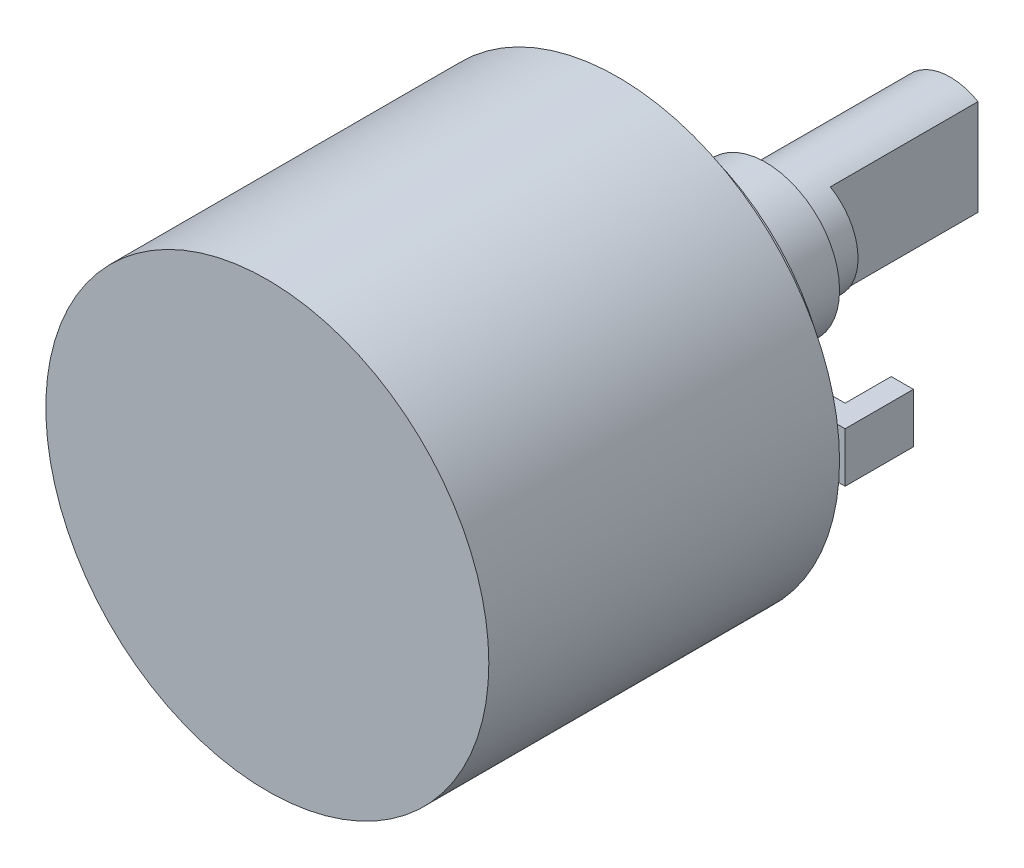
ISO-10303-21;
HEADER;
FILE_DESCRIPTION(('STEP AP214'),'2;1');
FILE_NAME('part.step','',(''),(''),'','','');
FILE_SCHEMA(('AUTOMOTIVE_DESIGN { 1 0 10303 214 1 1 1 1 }'));
ENDSEC;
DATA;
#1=APPLICATION_CONTEXT('core data for automotive mechanical design processes');
#2=APPLICATION_PROTOCOL_DEFINITION('international standard','automotive_design',2000,#1);
#3=PRODUCT_CONTEXT('',#1,'mechanical');
#4=PRODUCT('Part','Part','',(#3));
#5=PRODUCT_RELATED_PRODUCT_CATEGORY('part','',(#4));
#6=PRODUCT_DEFINITION_FORMATION('','',#4);
#7=PRODUCT_DEFINITION_CONTEXT('part definition',#1,'design');
#8=PRODUCT_DEFINITION('design','',#6,#7);
#9=PRODUCT_DEFINITION_SHAPE('','',#8);
#10=(LENGTH_UNIT() NAMED_UNIT(*) SI_UNIT(.MILLI.,.METRE.));
#11=(NAMED_UNIT(*) PLANE_ANGLE_UNIT() SI_UNIT($,.RADIAN.));
#12=(NAMED_UNIT(*) SI_UNIT($,.STERADIAN.) SOLID_ANGLE_UNIT());
#13=UNCERTAINTY_MEASURE_WITH_UNIT(LENGTH_MEASURE(1.E-05),#10,'distance_accuracy_value','');
#14=(GEOMETRIC_REPRESENTATION_CONTEXT(3) GLOBAL_UNCERTAINTY_ASSIGNED_CONTEXT((#13)) GLOBAL_UNIT_ASSIGNED_CONTEXT((#10,
#11,#12)) REPRESENTATION_CONTEXT('',''));
#15=CARTESIAN_POINT('',(0.,0.,0.));
#16=DIRECTION('',(0.,0.,1.));
#17=DIRECTION('',(1.,0.,0.));
#18=AXIS2_PLACEMENT_3D('',#15,#16,#17);
#19=CARTESIAN_POINT('',(0.,10.,0.));
#20=DIRECTION('',(0.,0.,1.));
#21=DIRECTION('',(1.,0.,0.));
#22=AXIS2_PLACEMENT_3D('',#19,#20,#21);
#23=PLANE('',#22);
#24=CARTESIAN_POINT('',(0.,0.,0.));
#25=DIRECTION('',(0.,0.,1.));
#26=DIRECTION('',(1.,0.,0.));
#27=AXIS2_PLACEMENT_3D('',#24,#25,#26);
#28=CIRCLE('',#27,4.);
#29=CARTESIAN_POINT('',(4.,0.,0.));
#30=VERTEX_POINT('',#29);
#31=EDGE_CURVE('E194',#30,#30,#28,.T.);
#32=ORIENTED_EDGE('',*,*,#31,.T.);
#33=EDGE_LOOP('',(#32));
#34=FACE_BOUND('',#33,.T.);
#35=DIRECTION('',(0.,1.,0.));
#36=VECTOR('',#35,1.);
#37=CARTESIAN_POINT('',(10.8,1.35,0.));
#38=LINE('',#37,#36);
#39=CARTESIAN_POINT('',(10.8,-1.35,0.));
#40=VERTEX_POINT('',#39);
#41=CARTESIAN_POINT('',(10.8,1.35,0.));
#42=VERTEX_POINT('',#41);
#43=EDGE_CURVE('E126',#40,#42,#38,.T.);
#44=ORIENTED_EDGE('',*,*,#43,.F.);
#45=DIRECTION('',(1.,0.,0.));
#46=VECTOR('',#45,1.);
#47=CARTESIAN_POINT('',(0.,-1.35,0.));
#48=LINE('',#47,#46);
#49=CARTESIAN_POINT('',(9.9084559846628,-1.35,0.));
#50=VERTEX_POINT('',#49);
#51=EDGE_CURVE('E159',#50,#40,#48,.T.);
#52=ORIENTED_EDGE('',*,*,#51,.F.);
#53=CARTESIAN_POINT('',(0.,0.,0.));
#54=DIRECTION('',(0.,0.,1.));
#55=DIRECTION('',(1.,0.,0.));
#56=AXIS2_PLACEMENT_3D('',#53,#54,#55);
#57=CIRCLE('',#56,10.);
#58=CARTESIAN_POINT('',(9.9084559846628,1.35,0.));
#59=VERTEX_POINT('',#58);
#60=EDGE_CURVE('E198',#59,#50,#57,.T.);
#61=ORIENTED_EDGE('',*,*,#60,.F.);
#62=DIRECTION('',(-1.,0.,0.));
#63=VECTOR('',#62,1.);
#64=CARTESIAN_POINT('',(12.,1.35,0.));
#65=LINE('',#64,#63);
#66=EDGE_CURVE('E153',#42,#59,#65,.T.);
#67=ORIENTED_EDGE('',*,*,#66,.F.);
#68=EDGE_LOOP('',(#44,#52,#61,#67));
#69=FACE_BOUND('',#68,.T.);
#70=ADVANCED_FACE('F42',(#34,#69),#23,.F.);
#71=CARTESIAN_POINT('',(0.,0.,20.5));
#72=DIRECTION('',(0.,0.,1.));
#73=DIRECTION('',(1.,0.,0.));
#74=AXIS2_PLACEMENT_3D('',#71,#72,#73);
#75=CYLINDRICAL_SURFACE('',#74,10.);
#76=CARTESIAN_POINT('',(0.,0.,1.5));
#77=DIRECTION('',(0.,0.,1.));
#78=DIRECTION('',(1.,0.,0.));
#79=AXIS2_PLACEMENT_3D('',#76,#77,#78);
#80=CIRCLE('',#79,10.);
#81=CARTESIAN_POINT('',(10.,0.,1.5));
#82=VERTEX_POINT('',#81);
#83=EDGE_CURVE('E201',#82,#82,#80,.T.);
#84=ORIENTED_EDGE('',*,*,#83,.F.);
#85=EDGE_LOOP('',(#84));
#86=FACE_BOUND('',#85,.T.);
#87=DIRECTION('',(0.,0.,1.));
#88=VECTOR('',#87,1.);
#89=CARTESIAN_POINT('',(9.9084559846628,1.35,20.5));
#90=LINE('',#89,#88);
#91=CARTESIAN_POINT('',(9.9084559846628,1.35,1.2));
#92=VERTEX_POINT('',#91);
#93=EDGE_CURVE('E180',#59,#92,#90,.T.);
#94=ORIENTED_EDGE('',*,*,#93,.F.);
#95=ORIENTED_EDGE('',*,*,#60,.T.);
#96=DIRECTION('',(0.,0.,1.));
#97=VECTOR('',#96,1.);
#98=CARTESIAN_POINT('',(9.9084559846628,-1.35,20.5));
#99=LINE('',#98,#97);
#100=CARTESIAN_POINT('',(9.9084559846628,-1.35,1.2));
#101=VERTEX_POINT('',#100);
#102=EDGE_CURVE('E176',#101,#50,#99,.F.);
#103=ORIENTED_EDGE('',*,*,#102,.F.);
#104=CARTESIAN_POINT('',(0.,0.,1.2));
#105=DIRECTION('',(0.,0.,1.));
#106=DIRECTION('',(1.,0.,0.));
#107=AXIS2_PLACEMENT_3D('',#104,#105,#106);
#108=CIRCLE('',#107,10.);
#109=EDGE_CURVE('E13',#101,#92,#108,.T.);
#110=ORIENTED_EDGE('',*,*,#109,.T.);
#111=EDGE_LOOP('',(#94,#95,#103,#110));
#112=FACE_BOUND('',#111,.T.);
#113=ADVANCED_FACE('F225',(#86,#112),#75,.T.);
#114=CARTESIAN_POINT('',(0.,0.,20.5));
#115=DIRECTION('',(0.,0.,-1.));
#116=DIRECTION('',(-1.,0.,0.));
#117=AXIS2_PLACEMENT_3D('',#114,#115,#116);
#118=PLANE('',#117);
#119=CARTESIAN_POINT('',(0.,0.,20.5));
#120=DIRECTION('',(0.,0.,1.));
#121=DIRECTION('',(1.,0.,0.));
#122=AXIS2_PLACEMENT_3D('',#119,#120,#121);
#123=CIRCLE('',#122,12.);
#124=CARTESIAN_POINT('',(12.,0.,20.5));
#125=VERTEX_POINT('',#124);
#126=EDGE_CURVE('E51',#125,#125,#123,.T.);
#127=ORIENTED_EDGE('',*,*,#126,.T.);
#128=EDGE_LOOP('',(#127));
#129=FACE_BOUND('',#128,.T.);
#130=ADVANCED_FACE('F44',(#129),#118,.F.);
#131=CARTESIAN_POINT('',(0.,0.,20.5));
#132=DIRECTION('',(0.,0.,1.));
#133=DIRECTION('',(1.,0.,0.));
#134=AXIS2_PLACEMENT_3D('',#131,#132,#133);
#135=CYLINDRICAL_SURFACE('',#134,12.);
#136=ORIENTED_EDGE('',*,*,#126,.F.);
#137=EDGE_LOOP('',(#136));
#138=FACE_BOUND('',#137,.T.);
#139=CARTESIAN_POINT('',(0.,0.,1.5));
#140=DIRECTION('',(0.,0.,1.));
#141=DIRECTION('',(1.,0.,0.));
#142=AXIS2_PLACEMENT_3D('',#139,#140,#141);
#143=CIRCLE('',#142,12.);
#144=CARTESIAN_POINT('',(12.,0.,1.5));
#145=VERTEX_POINT('',#144);
#146=EDGE_CURVE('E205',#145,#145,#143,.T.);
#147=ORIENTED_EDGE('',*,*,#146,.T.);
#148=EDGE_LOOP('',(#147));
#149=FACE_BOUND('',#148,.T.);
#150=ADVANCED_FACE('F213',(#138,#149),#135,.T.);
#151=CARTESIAN_POINT('',(0.,12.,1.5));
#152=DIRECTION('',(0.,0.,1.));
#153=DIRECTION('',(1.,0.,0.));
#154=AXIS2_PLACEMENT_3D('',#151,#152,#153);
#155=PLANE('',#154);
#156=ORIENTED_EDGE('',*,*,#146,.F.);
#157=EDGE_LOOP('',(#156));
#158=FACE_BOUND('',#157,.T.);
#159=ORIENTED_EDGE('',*,*,#83,.T.);
#160=EDGE_LOOP('',(#159));
#161=FACE_BOUND('',#160,.T.);
#162=ADVANCED_FACE('F216',(#158,#161),#155,.F.);
#163=CARTESIAN_POINT('',(0.,0.,20.5));
#164=DIRECTION('',(0.,0.,1.));
#165=DIRECTION('',(1.,0.,0.));
#166=AXIS2_PLACEMENT_3D('',#163,#164,#165);
#167=CYLINDRICAL_SURFACE('',#166,4.);
#168=ORIENTED_EDGE('',*,*,#31,.F.);
#169=EDGE_LOOP('',(#168));
#170=FACE_BOUND('',#169,.T.);
#171=CARTESIAN_POINT('',(0.,0.,-6.5));
#172=DIRECTION('',(0.,0.,1.));
#173=DIRECTION('',(1.,0.,0.));
#174=AXIS2_PLACEMENT_3D('',#171,#172,#173);
#175=CIRCLE('',#174,4.);
#176=CARTESIAN_POINT('',(4.,0.,-6.5));
#177=VERTEX_POINT('',#176);
#178=EDGE_CURVE('E190',#177,#177,#175,.T.);
#179=ORIENTED_EDGE('',*,*,#178,.T.);
#180=EDGE_LOOP('',(#179));
#181=FACE_BOUND('',#180,.T.);
#182=ADVANCED_FACE('F221',(#170,#181),#167,.T.);
#183=CARTESIAN_POINT('',(0.,4.,-6.5));
#184=DIRECTION('',(0.,0.,1.));
#185=DIRECTION('',(1.,0.,0.));
#186=AXIS2_PLACEMENT_3D('',#183,#184,#185);
#187=PLANE('',#186);
#188=ORIENTED_EDGE('',*,*,#178,.F.);
#189=EDGE_LOOP('',(#188));
#190=FACE_BOUND('',#189,.T.);
#191=CARTESIAN_POINT('',(0.,0.,-6.5));
#192=DIRECTION('',(0.,0.,1.));
#193=DIRECTION('',(1.,0.,0.));
#194=AXIS2_PLACEMENT_3D('',#191,#192,#193);
#195=CIRCLE('',#194,3.);
#196=CARTESIAN_POINT('',(3.,0.,-6.5));
#197=VERTEX_POINT('',#196);
#198=EDGE_CURVE('E186',#197,#197,#195,.T.);
#199=ORIENTED_EDGE('',*,*,#198,.T.);
#200=EDGE_LOOP('',(#199));
#201=FACE_BOUND('',#200,.T.);
#202=ADVANCED_FACE('F273',(#190,#201),#187,.F.);
#203=CARTESIAN_POINT('',(0.,0.,20.5));
#204=DIRECTION('',(0.,0.,1.));
#205=DIRECTION('',(1.,0.,0.));
#206=AXIS2_PLACEMENT_3D('',#203,#204,#205);
#207=CYLINDRICAL_SURFACE('',#206,3.);
#208=ORIENTED_EDGE('',*,*,#198,.F.);
#209=EDGE_LOOP('',(#208));
#210=FACE_BOUND('',#209,.T.);
#211=CARTESIAN_POINT('',(0.,0.,-16.5));
#212=DIRECTION('',(0.,0.,1.));
#213=DIRECTION('',(1.,0.,0.));
#214=AXIS2_PLACEMENT_3D('',#211,#212,#213);
#215=CIRCLE('',#214,3.);
#216=CARTESIAN_POINT('',(1.5,2.59807621135331,-16.5));
#217=VERTEX_POINT('',#216);
#218=CARTESIAN_POINT('',(1.5,-2.59807621135331,-16.5));
#219=VERTEX_POINT('',#218);
#220=EDGE_CURVE('E183',#217,#219,#215,.T.);
#221=ORIENTED_EDGE('',*,*,#220,.T.);
#222=DIRECTION('',(0.,0.,-1.));
#223=VECTOR('',#222,1.);
#224=CARTESIAN_POINT('',(1.5,-2.59807621135331,-1.09167308680401));
#225=LINE('',#224,#223);
#226=CARTESIAN_POINT('',(1.5,-2.59807621135331,-8.5));
#227=VERTEX_POINT('',#226);
#228=EDGE_CURVE('E58',#227,#219,#225,.T.);
#229=ORIENTED_EDGE('',*,*,#228,.F.);
#230=CARTESIAN_POINT('',(0.,0.,-8.5));
#231=DIRECTION('',(0.,0.,1.));
#232=DIRECTION('',(1.,0.,0.));
#233=AXIS2_PLACEMENT_3D('',#230,#231,#232);
#234=CIRCLE('',#233,3.);
#235=CARTESIAN_POINT('',(1.5,2.59807621135331,-8.5));
#236=VERTEX_POINT('',#235);
#237=EDGE_CURVE('E116',#236,#227,#234,.F.);
#238=ORIENTED_EDGE('',*,*,#237,.F.);
#239=DIRECTION('',(0.,0.,-1.));
#240=VECTOR('',#239,1.);
#241=CARTESIAN_POINT('',(1.5,2.59807621135331,-1.09167308680401));
#242=LINE('',#241,#240);
#243=EDGE_CURVE('E105',#236,#217,#242,.T.);
#244=ORIENTED_EDGE('',*,*,#243,.T.);
#245=EDGE_LOOP('',(#221,#229,#238,#244));
#246=FACE_BOUND('',#245,.T.);
#247=ADVANCED_FACE('F122',(#210,#246),#207,.T.);
#248=CARTESIAN_POINT('',(0.,3.,-16.5));
#249=DIRECTION('',(0.,0.,1.));
#250=DIRECTION('',(1.,0.,0.));
#251=AXIS2_PLACEMENT_3D('',#248,#249,#250);
#252=PLANE('',#251);
#253=ORIENTED_EDGE('',*,*,#220,.F.);
#254=DIRECTION('',(0.,1.,0.));
#255=VECTOR('',#254,1.);
#256=CARTESIAN_POINT('',(1.5,2.59807621135331,-16.5));
#257=LINE('',#256,#255);
#258=EDGE_CURVE('E110',#219,#217,#257,.T.);
#259=ORIENTED_EDGE('',*,*,#258,.F.);
#260=EDGE_LOOP('',(#253,#259));
#261=FACE_BOUND('',#260,.T.);
#262=ADVANCED_FACE('F263',(#261),#252,.F.);
#263=CARTESIAN_POINT('',(12.,1.35,1.2));
#264=DIRECTION('',(0.,-1.,0.));
#265=DIRECTION('',(0.,0.,-1.));
#266=AXIS2_PLACEMENT_3D('',#263,#264,#265);
#267=PLANE('',#266);
#268=DIRECTION('',(0.,0.,-1.));
#269=VECTOR('',#268,1.);
#270=CARTESIAN_POINT('',(12.,1.35,1.2));
#271=LINE('',#270,#269);
#272=CARTESIAN_POINT('',(12.,1.35,1.2));
#273=VERTEX_POINT('',#272);
#274=CARTESIAN_POINT('',(12.,1.35,-2.5));
#275=VERTEX_POINT('',#274);
#276=EDGE_CURVE('E165',#273,#275,#271,.T.);
#277=ORIENTED_EDGE('',*,*,#276,.T.);
#278=DIRECTION('',(1.,0.,0.));
#279=VECTOR('',#278,1.);
#280=CARTESIAN_POINT('',(12.,1.35,-2.5));
#281=LINE('',#280,#279);
#282=CARTESIAN_POINT('',(10.8,1.35,-2.5));
#283=VERTEX_POINT('',#282);
#284=EDGE_CURVE('E140',#283,#275,#281,.T.);
#285=ORIENTED_EDGE('',*,*,#284,.F.);
#286=DIRECTION('',(0.,0.,1.));
#287=VECTOR('',#286,1.);
#288=CARTESIAN_POINT('',(10.8,1.35,-2.5));
#289=LINE('',#288,#287);
#290=EDGE_CURVE('E144',#283,#42,#289,.T.);
#291=ORIENTED_EDGE('',*,*,#290,.T.);
#292=ORIENTED_EDGE('',*,*,#66,.T.);
#293=ORIENTED_EDGE('',*,*,#93,.T.);
#294=DIRECTION('',(-1.,0.,0.));
#295=VECTOR('',#294,1.);
#296=CARTESIAN_POINT('',(12.,1.35,1.2));
#297=LINE('',#296,#295);
#298=EDGE_CURVE('E154',#273,#92,#297,.T.);
#299=ORIENTED_EDGE('',*,*,#298,.F.);
#300=EDGE_LOOP('',(#277,#285,#291,#292,#293,#299));
#301=FACE_BOUND('',#300,.T.);
#302=ADVANCED_FACE('F231',(#301),#267,.F.);
#303=CARTESIAN_POINT('',(0.,-1.35,1.2));
#304=DIRECTION('',(0.,1.,0.));
#305=DIRECTION('',(0.,0.,1.));
#306=AXIS2_PLACEMENT_3D('',#303,#304,#305);
#307=PLANE('',#306);
#308=DIRECTION('',(1.,0.,0.));
#309=VECTOR('',#308,1.);
#310=CARTESIAN_POINT('',(0.,-1.35,1.2));
#311=LINE('',#310,#309);
#312=CARTESIAN_POINT('',(12.,-1.35,1.2));
#313=VERTEX_POINT('',#312);
#314=EDGE_CURVE('E158',#101,#313,#311,.T.);
#315=ORIENTED_EDGE('',*,*,#314,.F.);
#316=ORIENTED_EDGE('',*,*,#102,.T.);
#317=ORIENTED_EDGE('',*,*,#51,.T.);
#318=DIRECTION('',(0.,0.,1.));
#319=VECTOR('',#318,1.);
#320=CARTESIAN_POINT('',(10.8,-1.35,-2.5));
#321=LINE('',#320,#319);
#322=CARTESIAN_POINT('',(10.8,-1.35,-2.5));
#323=VERTEX_POINT('',#322);
#324=EDGE_CURVE('E150',#323,#40,#321,.T.);
#325=ORIENTED_EDGE('',*,*,#324,.F.);
#326=DIRECTION('',(-1.,0.,0.));
#327=VECTOR('',#326,1.);
#328=CARTESIAN_POINT('',(12.,-1.35,-2.5));
#329=LINE('',#328,#327);
#330=CARTESIAN_POINT('',(12.,-1.35,-2.5));
#331=VERTEX_POINT('',#330);
#332=EDGE_CURVE('E134',#331,#323,#329,.T.);
#333=ORIENTED_EDGE('',*,*,#332,.F.);
#334=DIRECTION('',(0.,0.,-1.));
#335=VECTOR('',#334,1.);
#336=CARTESIAN_POINT('',(12.,-1.35,1.2));
#337=LINE('',#336,#335);
#338=EDGE_CURVE('E173',#313,#331,#337,.T.);
#339=ORIENTED_EDGE('',*,*,#338,.F.);
#340=EDGE_LOOP('',(#315,#316,#317,#325,#333,#339));
#341=FACE_BOUND('',#340,.T.);
#342=ADVANCED_FACE('F255',(#341),#307,.F.);
#343=CARTESIAN_POINT('',(12.,1.35,1.2));
#344=DIRECTION('',(-1.,0.,0.));
#345=DIRECTION('',(0.,0.,1.));
#346=AXIS2_PLACEMENT_3D('',#343,#344,#345);
#347=PLANE('',#346);
#348=ORIENTED_EDGE('',*,*,#338,.T.);
#349=DIRECTION('',(0.,-1.,0.));
#350=VECTOR('',#349,1.);
#351=CARTESIAN_POINT('',(12.,1.35,-2.5));
#352=LINE('',#351,#350);
#353=EDGE_CURVE('E130',#275,#331,#352,.T.);
#354=ORIENTED_EDGE('',*,*,#353,.F.);
#355=ORIENTED_EDGE('',*,*,#276,.F.);
#356=DIRECTION('',(0.,1.,0.));
#357=VECTOR('',#356,1.);
#358=CARTESIAN_POINT('',(12.,1.35,1.2));
#359=LINE('',#358,#357);
#360=EDGE_CURVE('E162',#313,#273,#359,.T.);
#361=ORIENTED_EDGE('',*,*,#360,.F.);
#362=EDGE_LOOP('',(#348,#354,#355,#361));
#363=FACE_BOUND('',#362,.T.);
#364=ADVANCED_FACE('F241',(#363),#347,.F.);
#365=CARTESIAN_POINT('',(0.,0.,1.2));
#366=DIRECTION('',(0.,0.,1.));
#367=DIRECTION('',(1.,0.,0.));
#368=AXIS2_PLACEMENT_3D('',#365,#366,#367);
#369=PLANE('',#368);
#370=ORIENTED_EDGE('',*,*,#109,.F.);
#371=ORIENTED_EDGE('',*,*,#314,.T.);
#372=ORIENTED_EDGE('',*,*,#360,.T.);
#373=ORIENTED_EDGE('',*,*,#298,.T.);
#374=EDGE_LOOP('',(#370,#371,#372,#373));
#375=FACE_BOUND('',#374,.T.);
#376=ADVANCED_FACE('F234',(#375),#369,.T.);
#377=CARTESIAN_POINT('',(10.8,1.35,-2.5));
#378=DIRECTION('',(1.,0.,0.));
#379=DIRECTION('',(0.,0.,-1.));
#380=AXIS2_PLACEMENT_3D('',#377,#378,#379);
#381=PLANE('',#380);
#382=ORIENTED_EDGE('',*,*,#43,.T.);
#383=ORIENTED_EDGE('',*,*,#290,.F.);
#384=DIRECTION('',(0.,1.,0.));
#385=VECTOR('',#384,1.);
#386=CARTESIAN_POINT('',(10.8,1.35,-2.5));
#387=LINE('',#386,#385);
#388=EDGE_CURVE('E137',#323,#283,#387,.T.);
#389=ORIENTED_EDGE('',*,*,#388,.F.);
#390=ORIENTED_EDGE('',*,*,#324,.T.);
#391=EDGE_LOOP('',(#382,#383,#389,#390));
#392=FACE_BOUND('',#391,.T.);
#393=ADVANCED_FACE('F250',(#392),#381,.F.);
#394=CARTESIAN_POINT('',(0.,0.,-2.5));
#395=DIRECTION('',(0.,0.,-1.));
#396=DIRECTION('',(-1.,0.,0.));
#397=AXIS2_PLACEMENT_3D('',#394,#395,#396);
#398=PLANE('',#397);
#399=ORIENTED_EDGE('',*,*,#353,.T.);
#400=ORIENTED_EDGE('',*,*,#332,.T.);
#401=ORIENTED_EDGE('',*,*,#388,.T.);
#402=ORIENTED_EDGE('',*,*,#284,.T.);
#403=EDGE_LOOP('',(#399,#400,#401,#402));
#404=FACE_BOUND('',#403,.T.);
#405=ADVANCED_FACE('F244',(#404),#398,.T.);
#406=CARTESIAN_POINT('',(0.,4.,-8.5));
#407=DIRECTION('',(0.,0.,1.));
#408=DIRECTION('',(1.,0.,0.));
#409=AXIS2_PLACEMENT_3D('',#406,#407,#408);
#410=PLANE('',#409);
#411=ORIENTED_EDGE('',*,*,#237,.T.);
#412=DIRECTION('',(0.,1.,0.));
#413=VECTOR('',#412,1.);
#414=CARTESIAN_POINT('',(1.5,2.59807621135331,-8.5));
#415=LINE('',#414,#413);
#416=EDGE_CURVE('E108',#227,#236,#415,.T.);
#417=ORIENTED_EDGE('',*,*,#416,.T.);
#418=EDGE_LOOP('',(#411,#417));
#419=FACE_BOUND('',#418,.T.);
#420=ADVANCED_FACE('F119',(#419),#410,.F.);
#421=CARTESIAN_POINT('',(1.5,2.59807621135331,-1.09167308680401));
#422=DIRECTION('',(-1.,0.,0.));
#423=DIRECTION('',(0.,-1.,0.));
#424=AXIS2_PLACEMENT_3D('',#421,#422,#423);
#425=PLANE('',#424);
#426=ORIENTED_EDGE('',*,*,#228,.T.);
#427=ORIENTED_EDGE('',*,*,#258,.T.);
#428=ORIENTED_EDGE('',*,*,#243,.F.);
#429=ORIENTED_EDGE('',*,*,#416,.F.);
#430=EDGE_LOOP('',(#426,#427,#428,#429));
#431=FACE_BOUND('',#430,.T.);
#432=ADVANCED_FACE('F107',(#431),#425,.F.);
#433=CLOSED_SHELL('',(#70,#113,#130,#150,#162,#182,#202,#247,#262,#302,#342,#364,#376,#393,#405,
#420,#432));
#434=MANIFOLD_SOLID_BREP('B2',#433);
#435=ADVANCED_BREP_SHAPE_REPRESENTATION('',(#18,#434),#14);
#436=SHAPE_DEFINITION_REPRESENTATION(#9,#435);
ENDSEC;
END-ISO-10303-21;
